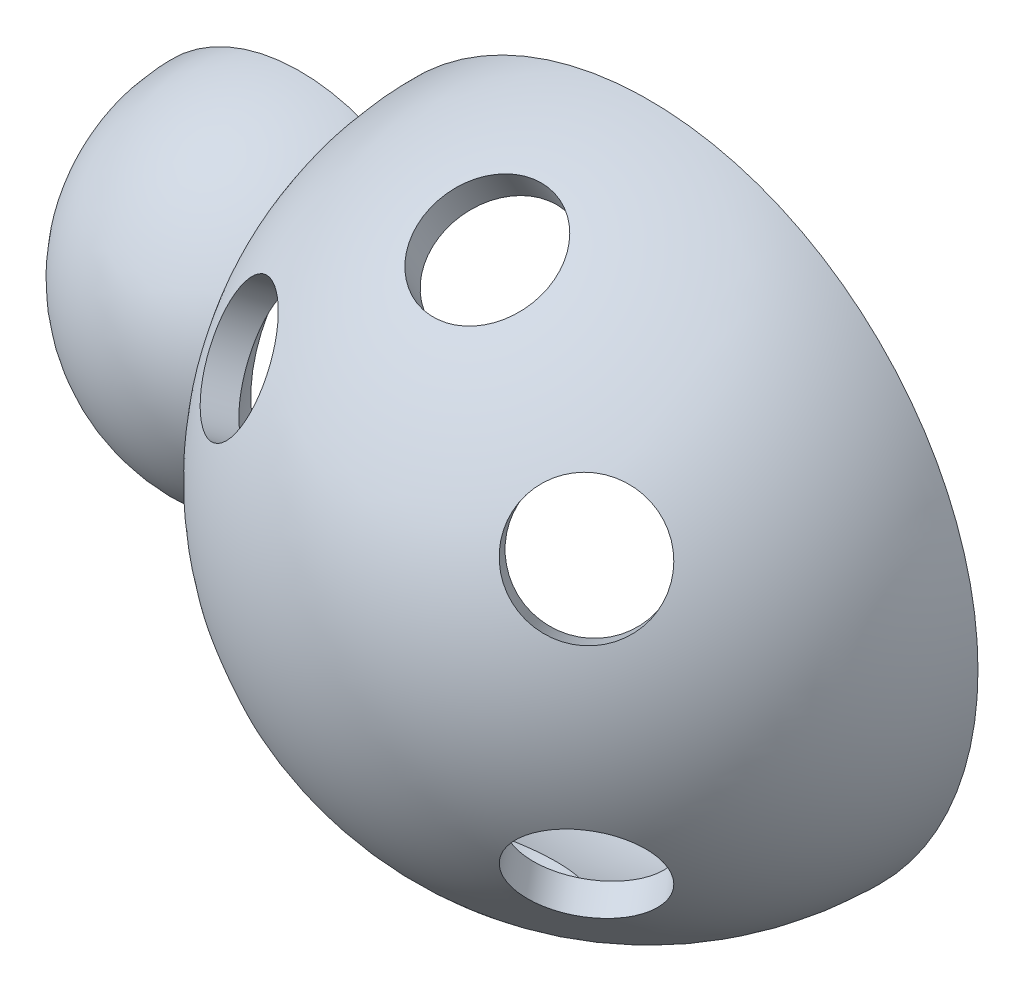
ISO-10303-21;
HEADER;
FILE_DESCRIPTION(('STEP AP214'),'2;1');
FILE_NAME('part.step','',(''),(''),'','','');
FILE_SCHEMA(('AUTOMOTIVE_DESIGN { 1 0 10303 214 1 1 1 1 }'));
ENDSEC;
DATA;
#1=APPLICATION_CONTEXT('core data for automotive mechanical design processes');
#2=APPLICATION_PROTOCOL_DEFINITION('international standard','automotive_design',2000,#1);
#3=PRODUCT_CONTEXT('',#1,'mechanical');
#4=PRODUCT('Part','Part','',(#3));
#5=PRODUCT_RELATED_PRODUCT_CATEGORY('part','',(#4));
#6=PRODUCT_DEFINITION_FORMATION('','',#4);
#7=PRODUCT_DEFINITION_CONTEXT('part definition',#1,'design');
#8=PRODUCT_DEFINITION('design','',#6,#7);
#9=PRODUCT_DEFINITION_SHAPE('','',#8);
#10=(LENGTH_UNIT() NAMED_UNIT(*) SI_UNIT(.MILLI.,.METRE.));
#11=(NAMED_UNIT(*) PLANE_ANGLE_UNIT() SI_UNIT($,.RADIAN.));
#12=(NAMED_UNIT(*) SI_UNIT($,.STERADIAN.) SOLID_ANGLE_UNIT());
#13=UNCERTAINTY_MEASURE_WITH_UNIT(LENGTH_MEASURE(1.E-05),#10,'distance_accuracy_value','');
#14=(GEOMETRIC_REPRESENTATION_CONTEXT(3) GLOBAL_UNCERTAINTY_ASSIGNED_CONTEXT((#13)) GLOBAL_UNIT_ASSIGNED_CONTEXT((#10,
#11,#12)) REPRESENTATION_CONTEXT('',''));
#15=CARTESIAN_POINT('',(0.,0.,0.));
#16=DIRECTION('',(0.,0.,1.));
#17=DIRECTION('',(1.,0.,0.));
#18=AXIS2_PLACEMENT_3D('',#15,#16,#17);
#19=CARTESIAN_POINT('',(0.,0.,0.));
#20=DIRECTION('',(-1.,0.,0.));
#21=DIRECTION('',(0.,-1.,0.));
#22=AXIS2_PLACEMENT_3D('',#19,#20,#21);
#23=SPHERICAL_SURFACE('',#22,60.);
#24=CARTESIAN_POINT('',(0.,50.8213783756403,29.3417364857638));
#25=DIRECTION('',(0.,-0.866025403784438,-0.500000000000001));
#26=DIRECTION('',(0.,0.500000000000001,-0.866025403784438));
#27=AXIS2_PLACEMENT_3D('',#24,#25,#26);
#28=CIRCLE('',#27,12.5);
#29=CARTESIAN_POINT('',(0.,57.0713783756403,18.5164189384583));
#30=VERTEX_POINT('',#29);
#31=EDGE_CURVE('E136',#30,#30,#28,.F.);
#32=ORIENTED_EDGE('',*,*,#31,.T.);
#33=EDGE_LOOP('',(#32));
#34=FACE_BOUND('',#33,.T.);
#35=CARTESIAN_POINT('',(31.5306070440332,24.7465695573889,42.862315786435));
#36=DIRECTION('',(-0.537299608346825,-0.421695722906441,-0.730398417408446));
#37=DIRECTION('',(-0.805523644784318,0.,0.592563631767415));
#38=AXIS2_PLACEMENT_3D('',#35,#36,#37);
#39=CIRCLE('',#38,12.5);
#40=CARTESIAN_POINT('',(21.4615614842293,24.7465695573889,50.2693611835277));
#41=VERTEX_POINT('',#40);
#42=EDGE_CURVE('E132',#41,#41,#39,.F.);
#43=ORIENTED_EDGE('',*,*,#42,.T.);
#44=EDGE_LOOP('',(#43));
#45=FACE_BOUND('',#44,.T.);
#46=CARTESIAN_POINT('',(-31.5306070440332,24.7465695573889,42.862315786435));
#47=DIRECTION('',(0.537299608346825,-0.421695722906441,-0.730398417408446));
#48=DIRECTION('',(-0.805523644784318,0.,-0.592563631767414));
#49=AXIS2_PLACEMENT_3D('',#46,#47,#48);
#50=CIRCLE('',#49,12.5);
#51=CARTESIAN_POINT('',(-41.5996526038372,24.7465695573889,35.4552703893423));
#52=VERTEX_POINT('',#51);
#53=EDGE_CURVE('E118',#52,#52,#50,.F.);
#54=ORIENTED_EDGE('',*,*,#53,.T.);
#55=EDGE_LOOP('',(#54));
#56=FACE_BOUND('',#55,.T.);
#57=CARTESIAN_POINT('',(-54.2857142857143,0.,0.));
#58=DIRECTION('',(-1.,0.,0.));
#59=DIRECTION('',(0.,0.,1.));
#60=AXIS2_PLACEMENT_3D('',#57,#58,#59);
#61=CIRCLE('',#60,25.5550625999976);
#62=CARTESIAN_POINT('',(-54.2857142857143,-25.5550625999976,-1.78450048361719E-13));
#63=VERTEX_POINT('',#62);
#64=CARTESIAN_POINT('',(-54.2857142857143,25.5550625999976,0.));
#65=VERTEX_POINT('',#64);
#66=EDGE_CURVE('E96',#63,#65,#61,.T.);
#67=ORIENTED_EDGE('',*,*,#66,.T.);
#68=CARTESIAN_POINT('',(0.,0.,0.));
#69=DIRECTION('',(0.,0.,1.));
#70=DIRECTION('',(-1.,0.,0.));
#71=AXIS2_PLACEMENT_3D('',#68,#69,#70);
#72=CIRCLE('',#71,60.);
#73=EDGE_CURVE('E113',#63,#65,#72,.T.);
#74=ORIENTED_EDGE('',*,*,#73,.F.);
#75=EDGE_LOOP('',(#67,#74));
#76=FACE_BOUND('',#75,.T.);
#77=CARTESIAN_POINT('',(-31.5306070440332,-24.7465695573889,42.862315786435));
#78=DIRECTION('',(0.537299608346825,0.421695722906441,-0.730398417408446));
#79=DIRECTION('',(-0.805523644784318,0.,-0.592563631767414));
#80=AXIS2_PLACEMENT_3D('',#77,#78,#79);
#81=CIRCLE('',#80,12.5);
#82=CARTESIAN_POINT('',(-41.5996526038372,-24.7465695573889,35.4552703893423));
#83=VERTEX_POINT('',#82);
#84=EDGE_CURVE('E140',#83,#83,#81,.T.);
#85=ORIENTED_EDGE('',*,*,#84,.F.);
#86=EDGE_LOOP('',(#85));
#87=FACE_BOUND('',#86,.T.);
#88=CARTESIAN_POINT('',(31.5306070440332,-24.7465695573889,42.862315786435));
#89=DIRECTION('',(-0.537299608346825,0.421695722906441,-0.730398417408446));
#90=DIRECTION('',(-0.805523644784318,0.,0.592563631767415));
#91=AXIS2_PLACEMENT_3D('',#88,#89,#90);
#92=CIRCLE('',#91,12.5);
#93=CARTESIAN_POINT('',(21.4615614842293,-24.7465695573889,50.2693611835277));
#94=VERTEX_POINT('',#93);
#95=EDGE_CURVE('E144',#94,#94,#92,.T.);
#96=ORIENTED_EDGE('',*,*,#95,.F.);
#97=EDGE_LOOP('',(#96));
#98=FACE_BOUND('',#97,.T.);
#99=CARTESIAN_POINT('',(0.,-50.8213783756403,29.3417364857638));
#100=DIRECTION('',(0.,0.866025403784438,-0.500000000000001));
#101=DIRECTION('',(0.,0.500000000000001,0.866025403784438));
#102=AXIS2_PLACEMENT_3D('',#99,#100,#101);
#103=CIRCLE('',#102,12.5);
#104=CARTESIAN_POINT('',(0.,-44.5713783756403,40.1670540330693));
#105=VERTEX_POINT('',#104);
#106=EDGE_CURVE('E148',#105,#105,#103,.T.);
#107=ORIENTED_EDGE('',*,*,#106,.F.);
#108=EDGE_LOOP('',(#107));
#109=FACE_BOUND('',#108,.T.);
#110=ADVANCED_FACE('F37',(#34,#45,#56,#76,#87,#98,#109),#23,.F.);
#111=CARTESIAN_POINT('',(0.,0.,0.));
#112=DIRECTION('',(-1.,0.,0.));
#113=DIRECTION('',(0.,-1.,0.));
#114=AXIS2_PLACEMENT_3D('',#111,#112,#113);
#115=SPHERICAL_SURFACE('',#114,66.);
#116=CARTESIAN_POINT('',(0.,56.1231903939895,32.4027390817506));
#117=DIRECTION('',(0.,-0.866025403784438,-0.500000000000001));
#118=DIRECTION('',(0.,0.500000000000001,-0.866025403784438));
#119=AXIS2_PLACEMENT_3D('',#116,#117,#118);
#120=CIRCLE('',#119,12.5);
#121=CARTESIAN_POINT('',(0.,62.3731903939895,21.5774215344451));
#122=VERTEX_POINT('',#121);
#123=EDGE_CURVE('E137',#122,#122,#120,.T.);
#124=ORIENTED_EDGE('',*,*,#123,.T.);
#125=EDGE_LOOP('',(#124));
#126=FACE_BOUND('',#125,.T.);
#127=CARTESIAN_POINT('',(34.8199580359778,27.3281929624551,47.3338186900187));
#128=DIRECTION('',(-0.537299608346825,-0.421695722906441,-0.730398417408446));
#129=DIRECTION('',(-0.805523644784318,0.,0.592563631767415));
#130=AXIS2_PLACEMENT_3D('',#127,#128,#129);
#131=CIRCLE('',#130,12.5);
#132=CARTESIAN_POINT('',(24.7509124761738,27.3281929624551,54.7408640871114));
#133=VERTEX_POINT('',#132);
#134=EDGE_CURVE('E133',#133,#133,#131,.T.);
#135=ORIENTED_EDGE('',*,*,#134,.T.);
#136=EDGE_LOOP('',(#135));
#137=FACE_BOUND('',#136,.T.);
#138=CARTESIAN_POINT('',(-34.8199580359778,27.3281929624551,47.3338186900187));
#139=DIRECTION('',(0.537299608346825,-0.421695722906441,-0.730398417408446));
#140=DIRECTION('',(-0.805523644784318,0.,-0.592563631767414));
#141=AXIS2_PLACEMENT_3D('',#138,#139,#140);
#142=CIRCLE('',#141,12.5);
#143=CARTESIAN_POINT('',(-44.8890035957817,27.3281929624551,39.926773292926));
#144=VERTEX_POINT('',#143);
#145=EDGE_CURVE('E129',#144,#144,#142,.T.);
#146=ORIENTED_EDGE('',*,*,#145,.T.);
#147=EDGE_LOOP('',(#146));
#148=FACE_BOUND('',#147,.T.);
#149=CARTESIAN_POINT('',(-56.8571428571429,0.,0.));
#150=DIRECTION('',(-1.,0.,0.));
#151=DIRECTION('',(0.,0.,1.));
#152=AXIS2_PLACEMENT_3D('',#149,#150,#151);
#153=CIRCLE('',#152,33.5151503968347);
#154=CARTESIAN_POINT('',(-56.8571428571429,-33.5151503968347,-2.34035044358139E-13));
#155=VERTEX_POINT('',#154);
#156=CARTESIAN_POINT('',(-56.8571428571429,33.5151503968347,0.));
#157=VERTEX_POINT('',#156);
#158=EDGE_CURVE('E58',#155,#157,#153,.T.);
#159=ORIENTED_EDGE('',*,*,#158,.F.);
#160=CARTESIAN_POINT('',(0.,0.,0.));
#161=DIRECTION('',(0.,0.,-1.));
#162=DIRECTION('',(-1.,0.,0.));
#163=AXIS2_PLACEMENT_3D('',#160,#161,#162);
#164=CIRCLE('',#163,66.);
#165=EDGE_CURVE('E116',#157,#155,#164,.T.);
#166=ORIENTED_EDGE('',*,*,#165,.F.);
#167=EDGE_LOOP('',(#159,#166));
#168=FACE_BOUND('',#167,.T.);
#169=CARTESIAN_POINT('',(-34.8199580359778,-27.3281929624551,47.3338186900187));
#170=DIRECTION('',(0.537299608346825,0.421695722906441,-0.730398417408446));
#171=DIRECTION('',(-0.805523644784318,0.,-0.592563631767414));
#172=AXIS2_PLACEMENT_3D('',#169,#170,#171);
#173=CIRCLE('',#172,12.5);
#174=CARTESIAN_POINT('',(-44.8890035957817,-27.3281929624551,39.926773292926));
#175=VERTEX_POINT('',#174);
#176=EDGE_CURVE('E141',#175,#175,#173,.F.);
#177=ORIENTED_EDGE('',*,*,#176,.F.);
#178=EDGE_LOOP('',(#177));
#179=FACE_BOUND('',#178,.T.);
#180=CARTESIAN_POINT('',(34.8199580359778,-27.3281929624551,47.3338186900187));
#181=DIRECTION('',(-0.537299608346825,0.421695722906441,-0.730398417408446));
#182=DIRECTION('',(-0.805523644784318,0.,0.592563631767415));
#183=AXIS2_PLACEMENT_3D('',#180,#181,#182);
#184=CIRCLE('',#183,12.5);
#185=CARTESIAN_POINT('',(24.7509124761738,-27.3281929624551,54.7408640871114));
#186=VERTEX_POINT('',#185);
#187=EDGE_CURVE('E145',#186,#186,#184,.F.);
#188=ORIENTED_EDGE('',*,*,#187,.F.);
#189=EDGE_LOOP('',(#188));
#190=FACE_BOUND('',#189,.T.);
#191=CARTESIAN_POINT('',(0.,-56.1231903939895,32.4027390817506));
#192=DIRECTION('',(0.,0.866025403784438,-0.500000000000001));
#193=DIRECTION('',(0.,0.500000000000001,0.866025403784438));
#194=AXIS2_PLACEMENT_3D('',#191,#192,#193);
#195=CIRCLE('',#194,12.5);
#196=CARTESIAN_POINT('',(0.,-49.8731903939895,43.228056629056));
#197=VERTEX_POINT('',#196);
#198=EDGE_CURVE('E149',#197,#197,#195,.F.);
#199=ORIENTED_EDGE('',*,*,#198,.F.);
#200=EDGE_LOOP('',(#199));
#201=FACE_BOUND('',#200,.T.);
#202=ADVANCED_FACE('F161',(#126,#137,#148,#168,#179,#190,#201),#115,.T.);
#203=CARTESIAN_POINT('',(-70.,0.,0.));
#204=DIRECTION('',(-1.,0.,0.));
#205=DIRECTION('',(0.,1.,0.));
#206=AXIS2_PLACEMENT_3D('',#203,#204,#205);
#207=SPHERICAL_SURFACE('',#206,30.);
#208=CARTESIAN_POINT('',(-70.,0.,0.));
#209=DIRECTION('',(0.,0.,1.));
#210=DIRECTION('',(1.,0.,0.));
#211=AXIS2_PLACEMENT_3D('',#208,#209,#210);
#212=CIRCLE('',#211,30.);
#213=CARTESIAN_POINT('',(-99.3202575022799,-6.35,0.));
#214=VERTEX_POINT('',#213);
#215=EDGE_CURVE('E114',#214,#63,#212,.T.);
#216=ORIENTED_EDGE('',*,*,#215,.F.);
#217=CARTESIAN_POINT('',(-70.,-6.35,0.));
#218=DIRECTION('',(0.,-1.,0.));
#219=DIRECTION('',(0.,0.,-1.));
#220=AXIS2_PLACEMENT_3D('',#217,#218,#219);
#221=CIRCLE('',#220,29.3202575022799);
#222=CARTESIAN_POINT('',(-98.0611386084029,-6.35,8.5));
#223=VERTEX_POINT('',#222);
#224=EDGE_CURVE('E156',#214,#223,#221,.F.);
#225=ORIENTED_EDGE('',*,*,#224,.T.);
#226=CARTESIAN_POINT('',(-70.,0.,8.5));
#227=DIRECTION('',(0.,0.,1.));
#228=DIRECTION('',(1.,0.,0.));
#229=AXIS2_PLACEMENT_3D('',#226,#227,#228);
#230=CIRCLE('',#229,28.7706447616316);
#231=CARTESIAN_POINT('',(-98.0611386084029,6.35,8.5));
#232=VERTEX_POINT('',#231);
#233=EDGE_CURVE('E107',#223,#232,#230,.F.);
#234=ORIENTED_EDGE('',*,*,#233,.T.);
#235=CARTESIAN_POINT('',(-70.,6.35,0.));
#236=DIRECTION('',(0.,1.,0.));
#237=DIRECTION('',(0.,0.,1.));
#238=AXIS2_PLACEMENT_3D('',#235,#236,#237);
#239=CIRCLE('',#238,29.3202575022799);
#240=CARTESIAN_POINT('',(-99.3202575022799,6.35,0.));
#241=VERTEX_POINT('',#240);
#242=EDGE_CURVE('E91',#232,#241,#239,.F.);
#243=ORIENTED_EDGE('',*,*,#242,.T.);
#244=EDGE_CURVE('E104',#65,#241,#212,.T.);
#245=ORIENTED_EDGE('',*,*,#244,.F.);
#246=ORIENTED_EDGE('',*,*,#66,.F.);
#247=EDGE_LOOP('',(#216,#225,#234,#243,#245,#246));
#248=FACE_BOUND('',#247,.T.);
#249=ADVANCED_FACE('F102',(#248),#207,.F.);
#250=CARTESIAN_POINT('',(-70.,0.,0.));
#251=DIRECTION('',(-1.,0.,0.));
#252=DIRECTION('',(0.,-1.,0.));
#253=AXIS2_PLACEMENT_3D('',#250,#251,#252);
#254=SPHERICAL_SURFACE('',#253,36.);
#255=CARTESIAN_POINT('',(-70.,0.,8.5));
#256=DIRECTION('',(0.,0.,1.));
#257=DIRECTION('',(1.,0.,0.));
#258=AXIS2_PLACEMENT_3D('',#255,#256,#257);
#259=CIRCLE('',#258,34.9821382994236);
#260=CARTESIAN_POINT('',(-104.400981090661,6.35,8.5));
#261=VERTEX_POINT('',#260);
#262=CARTESIAN_POINT('',(-104.400981090661,-6.35,8.5));
#263=VERTEX_POINT('',#262);
#264=EDGE_CURVE('E11',#261,#263,#259,.T.);
#265=ORIENTED_EDGE('',*,*,#264,.T.);
#266=CARTESIAN_POINT('',(-70.,-6.35,0.));
#267=DIRECTION('',(0.,-1.,0.));
#268=DIRECTION('',(0.,0.,-1.));
#269=AXIS2_PLACEMENT_3D('',#266,#267,#268);
#270=CIRCLE('',#269,35.4355400692582);
#271=CARTESIAN_POINT('',(-105.435540069258,-6.35,0.));
#272=VERTEX_POINT('',#271);
#273=EDGE_CURVE('E108',#263,#272,#270,.T.);
#274=ORIENTED_EDGE('',*,*,#273,.T.);
#275=CARTESIAN_POINT('',(-70.,0.,0.));
#276=DIRECTION('',(0.,0.,-1.));
#277=DIRECTION('',(1.,0.,0.));
#278=AXIS2_PLACEMENT_3D('',#275,#276,#277);
#279=CIRCLE('',#278,36.);
#280=EDGE_CURVE('E124',#155,#272,#279,.T.);
#281=ORIENTED_EDGE('',*,*,#280,.F.);
#282=ORIENTED_EDGE('',*,*,#158,.T.);
#283=CARTESIAN_POINT('',(-105.435540069258,6.35,0.));
#284=VERTEX_POINT('',#283);
#285=EDGE_CURVE('E123',#284,#157,#279,.T.);
#286=ORIENTED_EDGE('',*,*,#285,.F.);
#287=CARTESIAN_POINT('',(-70.,6.35,0.));
#288=DIRECTION('',(0.,1.,0.));
#289=DIRECTION('',(0.,0.,1.));
#290=AXIS2_PLACEMENT_3D('',#287,#288,#289);
#291=CIRCLE('',#290,35.4355400692582);
#292=EDGE_CURVE('E51',#284,#261,#291,.T.);
#293=ORIENTED_EDGE('',*,*,#292,.T.);
#294=EDGE_LOOP('',(#265,#274,#281,#282,#286,#293));
#295=FACE_BOUND('',#294,.T.);
#296=ADVANCED_FACE('F159',(#295),#254,.T.);
#297=CARTESIAN_POINT('',(-70.,0.,0.));
#298=DIRECTION('',(0.,0.,-1.));
#299=DIRECTION('',(1.,0.,0.));
#300=AXIS2_PLACEMENT_3D('',#297,#298,#299);
#301=PLANE('',#300);
#302=DIRECTION('',(-1.,0.,0.));
#303=VECTOR('',#302,1.);
#304=CARTESIAN_POINT('',(-70.,-6.35,0.));
#305=LINE('',#304,#303);
#306=EDGE_CURVE('E44',#214,#272,#305,.T.);
#307=ORIENTED_EDGE('',*,*,#306,.F.);
#308=ORIENTED_EDGE('',*,*,#215,.T.);
#309=ORIENTED_EDGE('',*,*,#73,.T.);
#310=ORIENTED_EDGE('',*,*,#244,.T.);
#311=DIRECTION('',(1.,0.,0.));
#312=VECTOR('',#311,1.);
#313=CARTESIAN_POINT('',(-70.,6.35,0.));
#314=LINE('',#313,#312);
#315=EDGE_CURVE('E88',#284,#241,#314,.T.);
#316=ORIENTED_EDGE('',*,*,#315,.F.);
#317=ORIENTED_EDGE('',*,*,#285,.T.);
#318=ORIENTED_EDGE('',*,*,#165,.T.);
#319=ORIENTED_EDGE('',*,*,#280,.T.);
#320=EDGE_LOOP('',(#307,#308,#309,#310,#316,#317,#318,#319));
#321=FACE_BOUND('',#320,.T.);
#322=ADVANCED_FACE('F111',(#321),#301,.T.);
#323=CARTESIAN_POINT('',(-30.0887780674222,23.6149604827607,40.902311374873));
#324=DIRECTION('',(-0.537299608346825,0.421695722906441,0.730398417408446));
#325=DIRECTION('',(0.805523644784318,0.,0.592563631767414));
#326=AXIS2_PLACEMENT_3D('',#323,#324,#325);
#327=CYLINDRICAL_SURFACE('',#326,12.5);
#328=ORIENTED_EDGE('',*,*,#145,.F.);
#329=EDGE_LOOP('',(#328));
#330=FACE_BOUND('',#329,.T.);
#331=ORIENTED_EDGE('',*,*,#53,.F.);
#332=EDGE_LOOP('',(#331));
#333=FACE_BOUND('',#332,.T.);
#334=ADVANCED_FACE('F186',(#330,#333),#327,.F.);
#335=CARTESIAN_POINT('',(30.0887780674222,23.6149604827607,40.902311374873));
#336=DIRECTION('',(0.537299608346825,0.421695722906441,0.730398417408446));
#337=DIRECTION('',(0.805523644784318,0.,-0.592563631767415));
#338=AXIS2_PLACEMENT_3D('',#335,#336,#337);
#339=CYLINDRICAL_SURFACE('',#338,12.5);
#340=ORIENTED_EDGE('',*,*,#134,.F.);
#341=EDGE_LOOP('',(#340));
#342=FACE_BOUND('',#341,.T.);
#343=ORIENTED_EDGE('',*,*,#42,.F.);
#344=EDGE_LOOP('',(#343));
#345=FACE_BOUND('',#344,.T.);
#346=ADVANCED_FACE('F183',(#342,#345),#339,.F.);
#347=CARTESIAN_POINT('',(0.,48.4974226119285,28.0000000000001));
#348=DIRECTION('',(0.,0.866025403784438,0.500000000000001));
#349=DIRECTION('',(0.,-0.500000000000001,0.866025403784438));
#350=AXIS2_PLACEMENT_3D('',#347,#348,#349);
#351=CYLINDRICAL_SURFACE('',#350,12.5);
#352=ORIENTED_EDGE('',*,*,#123,.F.);
#353=EDGE_LOOP('',(#352));
#354=FACE_BOUND('',#353,.T.);
#355=ORIENTED_EDGE('',*,*,#31,.F.);
#356=EDGE_LOOP('',(#355));
#357=FACE_BOUND('',#356,.T.);
#358=ADVANCED_FACE('F185',(#354,#357),#351,.F.);
#359=CARTESIAN_POINT('',(-30.0887780674222,-23.6149604827607,40.902311374873));
#360=DIRECTION('',(-0.537299608346825,-0.421695722906441,0.730398417408446));
#361=DIRECTION('',(0.805523644784318,0.,0.592563631767414));
#362=AXIS2_PLACEMENT_3D('',#359,#360,#361);
#363=CYLINDRICAL_SURFACE('',#362,12.5);
#364=ORIENTED_EDGE('',*,*,#176,.T.);
#365=EDGE_LOOP('',(#364));
#366=FACE_BOUND('',#365,.T.);
#367=ORIENTED_EDGE('',*,*,#84,.T.);
#368=EDGE_LOOP('',(#367));
#369=FACE_BOUND('',#368,.T.);
#370=ADVANCED_FACE('F193',(#366,#369),#363,.F.);
#371=CARTESIAN_POINT('',(30.0887780674222,-23.6149604827607,40.902311374873));
#372=DIRECTION('',(0.537299608346825,-0.421695722906441,0.730398417408446));
#373=DIRECTION('',(0.805523644784318,0.,-0.592563631767415));
#374=AXIS2_PLACEMENT_3D('',#371,#372,#373);
#375=CYLINDRICAL_SURFACE('',#374,12.5);
#376=ORIENTED_EDGE('',*,*,#187,.T.);
#377=EDGE_LOOP('',(#376));
#378=FACE_BOUND('',#377,.T.);
#379=ORIENTED_EDGE('',*,*,#95,.T.);
#380=EDGE_LOOP('',(#379));
#381=FACE_BOUND('',#380,.T.);
#382=ADVANCED_FACE('F254',(#378,#381),#375,.F.);
#383=CARTESIAN_POINT('',(0.,-48.4974226119285,28.0000000000001));
#384=DIRECTION('',(0.,-0.866025403784438,0.500000000000001));
#385=DIRECTION('',(0.,-0.500000000000001,-0.866025403784438));
#386=AXIS2_PLACEMENT_3D('',#383,#384,#385);
#387=CYLINDRICAL_SURFACE('',#386,12.5);
#388=ORIENTED_EDGE('',*,*,#198,.T.);
#389=EDGE_LOOP('',(#388));
#390=FACE_BOUND('',#389,.T.);
#391=ORIENTED_EDGE('',*,*,#106,.T.);
#392=EDGE_LOOP('',(#391));
#393=FACE_BOUND('',#392,.T.);
#394=ADVANCED_FACE('F263',(#390,#393),#387,.F.);
#395=CARTESIAN_POINT('',(-106.,6.35,8.5));
#396=DIRECTION('',(0.,0.,1.));
#397=DIRECTION('',(1.,0.,0.));
#398=AXIS2_PLACEMENT_3D('',#395,#396,#397);
#399=PLANE('',#398);
#400=DIRECTION('',(1.,0.,0.));
#401=VECTOR('',#400,1.);
#402=CARTESIAN_POINT('',(-106.,-6.35,8.5));
#403=LINE('',#402,#401);
#404=EDGE_CURVE('E163',#263,#223,#403,.T.);
#405=ORIENTED_EDGE('',*,*,#404,.F.);
#406=ORIENTED_EDGE('',*,*,#264,.F.);
#407=DIRECTION('',(1.,0.,0.));
#408=VECTOR('',#407,1.);
#409=CARTESIAN_POINT('',(-106.,6.35,8.5));
#410=LINE('',#409,#408);
#411=EDGE_CURVE('E165',#261,#232,#410,.T.);
#412=ORIENTED_EDGE('',*,*,#411,.T.);
#413=ORIENTED_EDGE('',*,*,#233,.F.);
#414=EDGE_LOOP('',(#405,#406,#412,#413));
#415=FACE_BOUND('',#414,.T.);
#416=ADVANCED_FACE('F272',(#415),#399,.F.);
#417=CARTESIAN_POINT('',(-106.,-6.35,0.));
#418=DIRECTION('',(0.,-1.,0.));
#419=DIRECTION('',(0.,0.,-1.));
#420=AXIS2_PLACEMENT_3D('',#417,#418,#419);
#421=PLANE('',#420);
#422=ORIENTED_EDGE('',*,*,#306,.T.);
#423=ORIENTED_EDGE('',*,*,#273,.F.);
#424=ORIENTED_EDGE('',*,*,#404,.T.);
#425=ORIENTED_EDGE('',*,*,#224,.F.);
#426=EDGE_LOOP('',(#422,#423,#424,#425));
#427=FACE_BOUND('',#426,.T.);
#428=ADVANCED_FACE('F153',(#427),#421,.F.);
#429=CARTESIAN_POINT('',(-106.,6.35,0.));
#430=DIRECTION('',(0.,1.,0.));
#431=DIRECTION('',(0.,0.,1.));
#432=AXIS2_PLACEMENT_3D('',#429,#430,#431);
#433=PLANE('',#432);
#434=ORIENTED_EDGE('',*,*,#411,.F.);
#435=ORIENTED_EDGE('',*,*,#292,.F.);
#436=ORIENTED_EDGE('',*,*,#315,.T.);
#437=ORIENTED_EDGE('',*,*,#242,.F.);
#438=EDGE_LOOP('',(#434,#435,#436,#437));
#439=FACE_BOUND('',#438,.T.);
#440=ADVANCED_FACE('F90',(#439),#433,.F.);
#441=CLOSED_SHELL('',(#110,#202,#249,#296,#322,#334,#346,#358,#370,#382,#394,#416,#428,#440));
#442=MANIFOLD_SOLID_BREP('B2',#441);
#443=ADVANCED_BREP_SHAPE_REPRESENTATION('',(#18,#442),#14);
#444=SHAPE_DEFINITION_REPRESENTATION(#9,#443);
ENDSEC;
END-ISO-10303-21;
